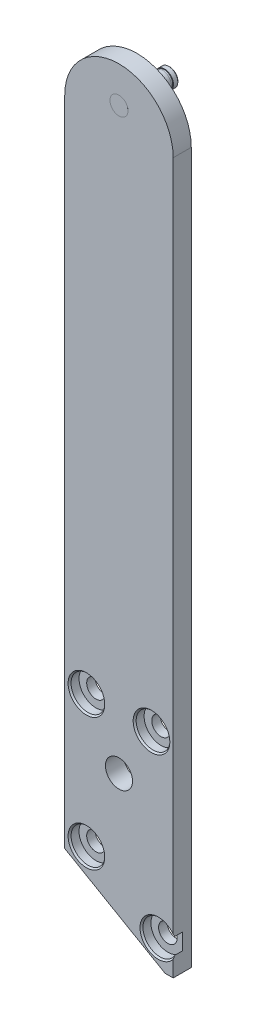
ISO-10303-21;
HEADER;
FILE_DESCRIPTION(('STEP AP214'),'2;1');
FILE_NAME('part.step','',(''),(''),'','','');
FILE_SCHEMA(('AUTOMOTIVE_DESIGN { 1 0 10303 214 1 1 1 1 }'));
ENDSEC;
DATA;
#1=APPLICATION_CONTEXT('core data for automotive mechanical design processes');
#2=APPLICATION_PROTOCOL_DEFINITION('international standard','automotive_design',2000,#1);
#3=PRODUCT_CONTEXT('',#1,'mechanical');
#4=PRODUCT('Part','Part','',(#3));
#5=PRODUCT_RELATED_PRODUCT_CATEGORY('part','',(#4));
#6=PRODUCT_DEFINITION_FORMATION('','',#4);
#7=PRODUCT_DEFINITION_CONTEXT('part definition',#1,'design');
#8=PRODUCT_DEFINITION('design','',#6,#7);
#9=PRODUCT_DEFINITION_SHAPE('','',#8);
#10=(LENGTH_UNIT() NAMED_UNIT(*) SI_UNIT(.MILLI.,.METRE.));
#11=(NAMED_UNIT(*) PLANE_ANGLE_UNIT() SI_UNIT($,.RADIAN.));
#12=(NAMED_UNIT(*) SI_UNIT($,.STERADIAN.) SOLID_ANGLE_UNIT());
#13=UNCERTAINTY_MEASURE_WITH_UNIT(LENGTH_MEASURE(1.E-05),#10,'distance_accuracy_value','');
#14=(GEOMETRIC_REPRESENTATION_CONTEXT(3) GLOBAL_UNCERTAINTY_ASSIGNED_CONTEXT((#13)) GLOBAL_UNIT_ASSIGNED_CONTEXT((#10,
#11,#12)) REPRESENTATION_CONTEXT('',''));
#15=CARTESIAN_POINT('',(0.,0.,0.));
#16=DIRECTION('',(0.,0.,1.));
#17=DIRECTION('',(1.,0.,0.));
#18=AXIS2_PLACEMENT_3D('',#15,#16,#17);
#19=CARTESIAN_POINT('',(0.,0.,6.35));
#20=DIRECTION('',(0.,0.,1.));
#21=DIRECTION('',(1.,0.,0.));
#22=AXIS2_PLACEMENT_3D('',#19,#20,#21);
#23=PLANE('',#22);
#24=CARTESIAN_POINT('',(0.,0.,6.35));
#25=DIRECTION('',(0.,0.,-1.));
#26=DIRECTION('',(-1.,0.,0.));
#27=AXIS2_PLACEMENT_3D('',#24,#25,#26);
#28=CIRCLE('',#27,3.175);
#29=CARTESIAN_POINT('',(-3.175,0.,6.35));
#30=VERTEX_POINT('',#29);
#31=EDGE_CURVE('E54',#30,#30,#28,.T.);
#32=ORIENTED_EDGE('',*,*,#31,.F.);
#33=EDGE_LOOP('',(#32));
#34=FACE_BOUND('',#33,.T.);
#35=ADVANCED_FACE('F43',(#34),#23,.T.);
#36=CARTESIAN_POINT('',(0.,0.,6.35));
#37=DIRECTION('',(0.,0.,-1.));
#38=DIRECTION('',(-1.,0.,0.));
#39=AXIS2_PLACEMENT_3D('',#36,#37,#38);
#40=CYLINDRICAL_SURFACE('',#39,3.175);
#41=ORIENTED_EDGE('',*,*,#31,.T.);
#42=EDGE_LOOP('',(#41));
#43=FACE_BOUND('',#42,.T.);
#44=CARTESIAN_POINT('',(0.,0.,-8.89));
#45=DIRECTION('',(0.,0.,-1.));
#46=DIRECTION('',(-1.,0.,0.));
#47=AXIS2_PLACEMENT_3D('',#44,#45,#46);
#48=CIRCLE('',#47,3.175);
#49=CARTESIAN_POINT('',(-3.175,0.,-8.89));
#50=VERTEX_POINT('',#49);
#51=EDGE_CURVE('E58',#50,#50,#48,.T.);
#52=ORIENTED_EDGE('',*,*,#51,.F.);
#53=EDGE_LOOP('',(#52));
#54=FACE_BOUND('',#53,.T.);
#55=ADVANCED_FACE('F90',(#43,#54),#40,.T.);
#56=CARTESIAN_POINT('',(0.,3.175,-8.89));
#57=DIRECTION('',(0.,0.,-1.));
#58=DIRECTION('',(-1.,0.,0.));
#59=AXIS2_PLACEMENT_3D('',#56,#57,#58);
#60=PLANE('',#59);
#61=ORIENTED_EDGE('',*,*,#51,.T.);
#62=EDGE_LOOP('',(#61));
#63=FACE_BOUND('',#62,.T.);
#64=CARTESIAN_POINT('',(0.,0.,-8.89));
#65=DIRECTION('',(0.,0.,-1.));
#66=DIRECTION('',(-1.,0.,0.));
#67=AXIS2_PLACEMENT_3D('',#64,#65,#66);
#68=CIRCLE('',#67,2.921);
#69=CARTESIAN_POINT('',(-2.921,0.,-8.89));
#70=VERTEX_POINT('',#69);
#71=EDGE_CURVE('E63',#70,#70,#68,.T.);
#72=ORIENTED_EDGE('',*,*,#71,.F.);
#73=EDGE_LOOP('',(#72));
#74=FACE_BOUND('',#73,.T.);
#75=ADVANCED_FACE('F86',(#63,#74),#60,.T.);
#76=CARTESIAN_POINT('',(0.,0.,6.35));
#77=DIRECTION('',(0.,0.,-1.));
#78=DIRECTION('',(-1.,0.,0.));
#79=AXIS2_PLACEMENT_3D('',#76,#77,#78);
#80=CYLINDRICAL_SURFACE('',#79,2.921);
#81=ORIENTED_EDGE('',*,*,#71,.T.);
#82=EDGE_LOOP('',(#81));
#83=FACE_BOUND('',#82,.T.);
#84=CARTESIAN_POINT('',(0.,0.,-9.6266));
#85=DIRECTION('',(0.,0.,-1.));
#86=DIRECTION('',(-1.,0.,0.));
#87=AXIS2_PLACEMENT_3D('',#84,#85,#86);
#88=CIRCLE('',#87,2.921);
#89=CARTESIAN_POINT('',(-2.921,0.,-9.6266));
#90=VERTEX_POINT('',#89);
#91=EDGE_CURVE('E66',#90,#90,#88,.T.);
#92=ORIENTED_EDGE('',*,*,#91,.F.);
#93=EDGE_LOOP('',(#92));
#94=FACE_BOUND('',#93,.T.);
#95=ADVANCED_FACE('F77',(#83,#94),#80,.T.);
#96=CARTESIAN_POINT('',(0.,3.175,-9.6266));
#97=DIRECTION('',(0.,0.,1.));
#98=DIRECTION('',(1.,0.,0.));
#99=AXIS2_PLACEMENT_3D('',#96,#97,#98);
#100=PLANE('',#99);
#101=ORIENTED_EDGE('',*,*,#91,.T.);
#102=EDGE_LOOP('',(#101));
#103=FACE_BOUND('',#102,.T.);
#104=CARTESIAN_POINT('',(0.,0.,-9.6266));
#105=DIRECTION('',(0.,0.,-1.));
#106=DIRECTION('',(-1.,0.,0.));
#107=AXIS2_PLACEMENT_3D('',#104,#105,#106);
#108=CIRCLE('',#107,3.175);
#109=CARTESIAN_POINT('',(-3.175,0.,-9.6266));
#110=VERTEX_POINT('',#109);
#111=EDGE_CURVE('E69',#110,#110,#108,.T.);
#112=ORIENTED_EDGE('',*,*,#111,.F.);
#113=EDGE_LOOP('',(#112));
#114=FACE_BOUND('',#113,.T.);
#115=ADVANCED_FACE('F75',(#103,#114),#100,.T.);
#116=CARTESIAN_POINT('',(0.,0.,6.35));
#117=DIRECTION('',(0.,0.,-1.));
#118=DIRECTION('',(-1.,0.,0.));
#119=AXIS2_PLACEMENT_3D('',#116,#117,#118);
#120=CYLINDRICAL_SURFACE('',#119,3.175);
#121=CARTESIAN_POINT('',(0.,0.,-11.1506));
#122=DIRECTION('',(0.,0.,-1.));
#123=DIRECTION('',(-1.,0.,0.));
#124=AXIS2_PLACEMENT_3D('',#121,#122,#123);
#125=CIRCLE('',#124,3.175);
#126=CARTESIAN_POINT('',(-3.175,0.,-11.1506));
#127=VERTEX_POINT('',#126);
#128=EDGE_CURVE('E11',#127,#127,#125,.F.);
#129=ORIENTED_EDGE('',*,*,#128,.T.);
#130=EDGE_LOOP('',(#129));
#131=FACE_BOUND('',#130,.T.);
#132=ORIENTED_EDGE('',*,*,#111,.T.);
#133=EDGE_LOOP('',(#132));
#134=FACE_BOUND('',#133,.T.);
#135=ADVANCED_FACE('F73',(#131,#134),#120,.T.);
#136=CARTESIAN_POINT('',(0.,0.,-11.5316));
#137=DIRECTION('',(0.,0.,-1.));
#138=DIRECTION('',(-1.,0.,0.));
#139=AXIS2_PLACEMENT_3D('',#136,#137,#138);
#140=PLANE('',#139);
#141=CARTESIAN_POINT('',(0.,0.,-11.5316));
#142=DIRECTION('',(0.,0.,-1.));
#143=DIRECTION('',(-1.,0.,0.));
#144=AXIS2_PLACEMENT_3D('',#141,#142,#143);
#145=CIRCLE('',#144,2.79400000000001);
#146=CARTESIAN_POINT('',(-2.79400000000001,0.,-11.5316));
#147=VERTEX_POINT('',#146);
#148=EDGE_CURVE('E50',#147,#147,#145,.T.);
#149=ORIENTED_EDGE('',*,*,#148,.T.);
#150=EDGE_LOOP('',(#149));
#151=FACE_BOUND('',#150,.T.);
#152=ADVANCED_FACE('F84',(#151),#140,.T.);
#153=CARTESIAN_POINT('',(0.,0.,-11.5316));
#154=DIRECTION('',(0.,0.,1.));
#155=DIRECTION('',(1.,0.,0.));
#156=AXIS2_PLACEMENT_3D('',#153,#154,#155);
#157=CONICAL_SURFACE('',#156,2.79400000000001,0.785398163397442);
#158=ORIENTED_EDGE('',*,*,#128,.F.);
#159=EDGE_LOOP('',(#158));
#160=FACE_BOUND('',#159,.T.);
#161=ORIENTED_EDGE('',*,*,#148,.F.);
#162=EDGE_LOOP('',(#161));
#163=FACE_BOUND('',#162,.T.);
#164=ADVANCED_FACE('F45',(#160,#163),#157,.T.);
#165=CLOSED_SHELL('',(#35,#55,#75,#95,#115,#135,#152,#164));
#166=MANIFOLD_SOLID_BREP('B2',#165);
#167=CARTESIAN_POINT('',(0.,-6.35,6.35));
#168=DIRECTION('',(0.,0.,-1.));
#169=DIRECTION('',(-1.,0.,0.));
#170=AXIS2_PLACEMENT_3D('',#167,#168,#169);
#171=CYLINDRICAL_SURFACE('',#170,19.05);
#172=DIRECTION('',(0.,0.,-1.));
#173=VECTOR('',#172,1.);
#174=CARTESIAN_POINT('',(-19.05,-6.35,6.35));
#175=LINE('',#174,#173);
#176=CARTESIAN_POINT('',(-19.05,-6.35,6.35));
#177=VERTEX_POINT('',#176);
#178=CARTESIAN_POINT('',(-19.05,-6.35,0.));
#179=VERTEX_POINT('',#178);
#180=EDGE_CURVE('E272',#177,#179,#175,.T.);
#181=ORIENTED_EDGE('',*,*,#180,.F.);
#182=CARTESIAN_POINT('',(0.,-6.35,6.35));
#183=DIRECTION('',(0.,0.,1.));
#184=DIRECTION('',(1.,0.,0.));
#185=AXIS2_PLACEMENT_3D('',#182,#183,#184);
#186=CIRCLE('',#185,19.05);
#187=CARTESIAN_POINT('',(19.05,-6.35000000000004,6.35));
#188=VERTEX_POINT('',#187);
#189=EDGE_CURVE('E276',#188,#177,#186,.T.);
#190=ORIENTED_EDGE('',*,*,#189,.F.);
#191=DIRECTION('',(0.,0.,-1.));
#192=VECTOR('',#191,1.);
#193=CARTESIAN_POINT('',(19.05,-6.35,6.35));
#194=LINE('',#193,#192);
#195=CARTESIAN_POINT('',(19.05,-6.35000000000004,0.));
#196=VERTEX_POINT('',#195);
#197=EDGE_CURVE('E244',#196,#188,#194,.F.);
#198=ORIENTED_EDGE('',*,*,#197,.F.);
#199=CARTESIAN_POINT('',(0.,-6.35,0.));
#200=DIRECTION('',(0.,0.,1.));
#201=DIRECTION('',(1.,0.,0.));
#202=AXIS2_PLACEMENT_3D('',#199,#200,#201);
#203=CIRCLE('',#202,19.05);
#204=EDGE_CURVE('E278',#179,#196,#203,.F.);
#205=ORIENTED_EDGE('',*,*,#204,.F.);
#206=EDGE_LOOP('',(#181,#190,#198,#205));
#207=FACE_BOUND('',#206,.T.);
#208=ADVANCED_FACE('F159',(#207),#171,.T.);
#209=CARTESIAN_POINT('',(0.,0.,6.35));
#210=DIRECTION('',(0.,0.,1.));
#211=DIRECTION('',(1.,0.,0.));
#212=AXIS2_PLACEMENT_3D('',#209,#210,#211);
#213=PLANE('',#212);
#214=CARTESIAN_POINT('',(-11.43,-184.7,6.35));
#215=DIRECTION('',(0.,0.,1.));
#216=DIRECTION('',(1.,0.,0.));
#217=AXIS2_PLACEMENT_3D('',#214,#215,#216);
#218=CIRCLE('',#217,6.4389);
#219=CARTESIAN_POINT('',(-4.99110000000003,-184.7,6.35));
#220=VERTEX_POINT('',#219);
#221=EDGE_CURVE('E410',#220,#220,#218,.T.);
#222=ORIENTED_EDGE('',*,*,#221,.F.);
#223=EDGE_LOOP('',(#222));
#224=FACE_BOUND('',#223,.T.);
#225=CARTESIAN_POINT('',(11.43,-184.7,6.35));
#226=DIRECTION('',(0.,0.,1.));
#227=DIRECTION('',(1.,0.,0.));
#228=AXIS2_PLACEMENT_3D('',#225,#226,#227);
#229=CIRCLE('',#228,6.4389);
#230=CARTESIAN_POINT('',(17.8689,-184.7,6.35));
#231=VERTEX_POINT('',#230);
#232=EDGE_CURVE('E398',#231,#231,#229,.T.);
#233=ORIENTED_EDGE('',*,*,#232,.F.);
#234=EDGE_LOOP('',(#233));
#235=FACE_BOUND('',#234,.T.);
#236=CARTESIAN_POINT('',(13.834070214,-246.4,6.35));
#237=DIRECTION('',(0.,0.,1.));
#238=DIRECTION('',(1.,0.,0.));
#239=AXIS2_PLACEMENT_3D('',#236,#237,#238);
#240=CIRCLE('',#239,6.4389);
#241=CARTESIAN_POINT('',(19.05,-242.624617942841,6.35));
#242=VERTEX_POINT('',#241);
#243=CARTESIAN_POINT('',(19.05,-250.175382057159,6.35));
#244=VERTEX_POINT('',#243);
#245=EDGE_CURVE('E177',#242,#244,#240,.T.);
#246=ORIENTED_EDGE('',*,*,#245,.F.);
#247=DIRECTION('',(0.,1.,0.));
#248=VECTOR('',#247,1.);
#249=CARTESIAN_POINT('',(19.05,12.7,6.35));
#250=LINE('',#249,#248);
#251=EDGE_CURVE('E184',#242,#188,#250,.T.);
#252=ORIENTED_EDGE('',*,*,#251,.T.);
#253=ORIENTED_EDGE('',*,*,#189,.T.);
#254=DIRECTION('',(0.,-1.,0.));
#255=VECTOR('',#254,1.);
#256=CARTESIAN_POINT('',(-19.05,12.7,6.35));
#257=LINE('',#256,#255);
#258=CARTESIAN_POINT('',(-19.05,-235.560177465372,6.35));
#259=VERTEX_POINT('',#258);
#260=EDGE_CURVE('E263',#177,#259,#257,.T.);
#261=ORIENTED_EDGE('',*,*,#260,.T.);
#262=DIRECTION('',(0.866025403784439,-0.5,0.));
#263=VECTOR('',#262,1.);
#264=CARTESIAN_POINT('',(16.1840702139999,-255.902577388071,6.35));
#265=LINE('',#264,#263);
#266=CARTESIAN_POINT('',(16.1840702139999,-255.902577388071,6.35));
#267=VERTEX_POINT('',#266);
#268=EDGE_CURVE('E250',#259,#267,#265,.T.);
#269=ORIENTED_EDGE('',*,*,#268,.T.);
#270=DIRECTION('',(1.,0.,0.));
#271=VECTOR('',#270,1.);
#272=CARTESIAN_POINT('',(16.1840702139999,-255.902577388071,6.35));
#273=LINE('',#272,#271);
#274=CARTESIAN_POINT('',(19.05,-255.902577388071,6.35));
#275=VERTEX_POINT('',#274);
#276=EDGE_CURVE('E246',#267,#275,#273,.T.);
#277=ORIENTED_EDGE('',*,*,#276,.T.);
#278=EDGE_CURVE('E245',#275,#244,#250,.T.);
#279=ORIENTED_EDGE('',*,*,#278,.T.);
#280=EDGE_LOOP('',(#246,#252,#253,#261,#269,#277,#279));
#281=FACE_BOUND('',#280,.T.);
#282=CARTESIAN_POINT('',(-11.43,-231.16,6.35));
#283=DIRECTION('',(0.,0.,1.));
#284=DIRECTION('',(1.,0.,0.));
#285=AXIS2_PLACEMENT_3D('',#282,#283,#284);
#286=CIRCLE('',#285,6.4389);
#287=CARTESIAN_POINT('',(-4.99110000000003,-231.16,6.35));
#288=VERTEX_POINT('',#287);
#289=EDGE_CURVE('E379',#288,#288,#286,.T.);
#290=ORIENTED_EDGE('',*,*,#289,.F.);
#291=EDGE_LOOP('',(#290));
#292=FACE_BOUND('',#291,.T.);
#293=CARTESIAN_POINT('',(0.,0.,6.35));
#294=DIRECTION('',(0.,0.,1.));
#295=DIRECTION('',(1.,0.,0.));
#296=AXIS2_PLACEMENT_3D('',#293,#294,#295);
#297=CIRCLE('',#296,3.175);
#298=CARTESIAN_POINT('',(3.175,0.,6.35));
#299=VERTEX_POINT('',#298);
#300=EDGE_CURVE('E257',#299,#299,#297,.T.);
#301=ORIENTED_EDGE('',*,*,#300,.F.);
#302=EDGE_LOOP('',(#301));
#303=FACE_BOUND('',#302,.T.);
#304=CARTESIAN_POINT('',(0.,-203.2,6.35));
#305=DIRECTION('',(0.,0.,1.));
#306=DIRECTION('',(1.,0.,0.));
#307=AXIS2_PLACEMENT_3D('',#304,#305,#306);
#308=CIRCLE('',#307,4.7625);
#309=CARTESIAN_POINT('',(4.76249999999991,-203.2,6.35));
#310=VERTEX_POINT('',#309);
#311=EDGE_CURVE('E364',#310,#310,#308,.T.);
#312=ORIENTED_EDGE('',*,*,#311,.F.);
#313=EDGE_LOOP('',(#312));
#314=FACE_BOUND('',#313,.T.);
#315=ADVANCED_FACE('F336',(#224,#235,#281,#292,#303,#314),#213,.T.);
#316=CARTESIAN_POINT('',(0.,0.,0.));
#317=DIRECTION('',(0.,0.,1.));
#318=DIRECTION('',(1.,0.,0.));
#319=AXIS2_PLACEMENT_3D('',#316,#317,#318);
#320=PLANE('',#319);
#321=CARTESIAN_POINT('',(-11.43,-184.7,0.));
#322=DIRECTION('',(0.,0.,1.));
#323=DIRECTION('',(1.,0.,0.));
#324=AXIS2_PLACEMENT_3D('',#321,#322,#323);
#325=CIRCLE('',#324,3.2639);
#326=CARTESIAN_POINT('',(-8.16610000000003,-184.7,0.));
#327=VERTEX_POINT('',#326);
#328=EDGE_CURVE('E163',#327,#327,#325,.T.);
#329=ORIENTED_EDGE('',*,*,#328,.T.);
#330=EDGE_LOOP('',(#329));
#331=FACE_BOUND('',#330,.T.);
#332=CARTESIAN_POINT('',(11.43,-184.7,0.));
#333=DIRECTION('',(0.,0.,1.));
#334=DIRECTION('',(1.,0.,0.));
#335=AXIS2_PLACEMENT_3D('',#332,#333,#334);
#336=CIRCLE('',#335,3.2639);
#337=CARTESIAN_POINT('',(14.6939,-184.7,0.));
#338=VERTEX_POINT('',#337);
#339=EDGE_CURVE('E388',#338,#338,#336,.T.);
#340=ORIENTED_EDGE('',*,*,#339,.T.);
#341=EDGE_LOOP('',(#340));
#342=FACE_BOUND('',#341,.T.);
#343=CARTESIAN_POINT('',(13.834070214,-246.4,0.));
#344=DIRECTION('',(0.,0.,1.));
#345=DIRECTION('',(1.,0.,0.));
#346=AXIS2_PLACEMENT_3D('',#343,#344,#345);
#347=CIRCLE('',#346,3.2639);
#348=CARTESIAN_POINT('',(17.097970214,-246.4,0.));
#349=VERTEX_POINT('',#348);
#350=EDGE_CURVE('E382',#349,#349,#347,.T.);
#351=ORIENTED_EDGE('',*,*,#350,.T.);
#352=EDGE_LOOP('',(#351));
#353=FACE_BOUND('',#352,.T.);
#354=CARTESIAN_POINT('',(-11.43,-231.16,0.));
#355=DIRECTION('',(0.,0.,1.));
#356=DIRECTION('',(1.,0.,0.));
#357=AXIS2_PLACEMENT_3D('',#354,#355,#356);
#358=CIRCLE('',#357,3.2639);
#359=CARTESIAN_POINT('',(-8.16610000000003,-231.16,0.));
#360=VERTEX_POINT('',#359);
#361=EDGE_CURVE('E280',#360,#360,#358,.T.);
#362=ORIENTED_EDGE('',*,*,#361,.T.);
#363=EDGE_LOOP('',(#362));
#364=FACE_BOUND('',#363,.T.);
#365=DIRECTION('',(0.,-1.,0.));
#366=VECTOR('',#365,1.);
#367=CARTESIAN_POINT('',(-19.05,12.7,0.));
#368=LINE('',#367,#366);
#369=CARTESIAN_POINT('',(-19.05,-235.560177465372,0.));
#370=VERTEX_POINT('',#369);
#371=EDGE_CURVE('E254',#179,#370,#368,.T.);
#372=ORIENTED_EDGE('',*,*,#371,.F.);
#373=ORIENTED_EDGE('',*,*,#204,.T.);
#374=DIRECTION('',(0.,1.,0.));
#375=VECTOR('',#374,1.);
#376=CARTESIAN_POINT('',(19.05,12.7,0.));
#377=LINE('',#376,#375);
#378=CARTESIAN_POINT('',(19.05,-255.902577388071,0.));
#379=VERTEX_POINT('',#378);
#380=EDGE_CURVE('E261',#379,#196,#377,.T.);
#381=ORIENTED_EDGE('',*,*,#380,.F.);
#382=DIRECTION('',(1.,0.,0.));
#383=VECTOR('',#382,1.);
#384=CARTESIAN_POINT('',(16.1840702139999,-255.902577388071,0.));
#385=LINE('',#384,#383);
#386=CARTESIAN_POINT('',(16.1840702139999,-255.902577388071,0.));
#387=VERTEX_POINT('',#386);
#388=EDGE_CURVE('E259',#387,#379,#385,.T.);
#389=ORIENTED_EDGE('',*,*,#388,.F.);
#390=DIRECTION('',(0.866025403784439,-0.5,0.));
#391=VECTOR('',#390,1.);
#392=CARTESIAN_POINT('',(16.1840702139999,-255.902577388071,0.));
#393=LINE('',#392,#391);
#394=EDGE_CURVE('E256',#370,#387,#393,.T.);
#395=ORIENTED_EDGE('',*,*,#394,.F.);
#396=EDGE_LOOP('',(#372,#373,#381,#389,#395));
#397=FACE_BOUND('',#396,.T.);
#398=CARTESIAN_POINT('',(0.,0.,0.));
#399=DIRECTION('',(0.,0.,1.));
#400=DIRECTION('',(1.,0.,0.));
#401=AXIS2_PLACEMENT_3D('',#398,#399,#400);
#402=CIRCLE('',#401,3.175);
#403=CARTESIAN_POINT('',(3.175,0.,0.));
#404=VERTEX_POINT('',#403);
#405=EDGE_CURVE('E361',#404,#404,#402,.T.);
#406=ORIENTED_EDGE('',*,*,#405,.T.);
#407=EDGE_LOOP('',(#406));
#408=FACE_BOUND('',#407,.T.);
#409=CARTESIAN_POINT('',(0.,-203.2,0.));
#410=DIRECTION('',(0.,0.,1.));
#411=DIRECTION('',(1.,0.,0.));
#412=AXIS2_PLACEMENT_3D('',#409,#410,#411);
#413=CIRCLE('',#412,4.7625);
#414=CARTESIAN_POINT('',(4.76249999999991,-203.2,0.));
#415=VERTEX_POINT('',#414);
#416=EDGE_CURVE('E282',#415,#415,#413,.T.);
#417=ORIENTED_EDGE('',*,*,#416,.T.);
#418=EDGE_LOOP('',(#417));
#419=FACE_BOUND('',#418,.T.);
#420=ADVANCED_FACE('F338',(#331,#342,#353,#364,#397,#408,#419),#320,.F.);
#421=CARTESIAN_POINT('',(-19.05,12.7,6.35));
#422=DIRECTION('',(1.,0.,0.));
#423=DIRECTION('',(0.,1.,0.));
#424=AXIS2_PLACEMENT_3D('',#421,#422,#423);
#425=PLANE('',#424);
#426=ORIENTED_EDGE('',*,*,#260,.F.);
#427=ORIENTED_EDGE('',*,*,#180,.T.);
#428=ORIENTED_EDGE('',*,*,#371,.T.);
#429=DIRECTION('',(0.,0.,-1.));
#430=VECTOR('',#429,1.);
#431=CARTESIAN_POINT('',(-19.05,-235.560177465372,6.35));
#432=LINE('',#431,#430);
#433=EDGE_CURVE('E269',#259,#370,#432,.T.);
#434=ORIENTED_EDGE('',*,*,#433,.F.);
#435=EDGE_LOOP('',(#426,#427,#428,#434));
#436=FACE_BOUND('',#435,.T.);
#437=ADVANCED_FACE('F341',(#436),#425,.F.);
#438=CARTESIAN_POINT('',(16.1840702139999,-255.902577388071,6.35));
#439=DIRECTION('',(0.5,0.866025403784439,0.));
#440=DIRECTION('',(-0.866025403784439,0.5,0.));
#441=AXIS2_PLACEMENT_3D('',#438,#439,#440);
#442=PLANE('',#441);
#443=ORIENTED_EDGE('',*,*,#394,.T.);
#444=DIRECTION('',(0.,0.,-1.));
#445=VECTOR('',#444,1.);
#446=CARTESIAN_POINT('',(16.1840702139999,-255.902577388071,6.35));
#447=LINE('',#446,#445);
#448=EDGE_CURVE('E266',#267,#387,#447,.T.);
#449=ORIENTED_EDGE('',*,*,#448,.F.);
#450=ORIENTED_EDGE('',*,*,#268,.F.);
#451=ORIENTED_EDGE('',*,*,#433,.T.);
#452=EDGE_LOOP('',(#443,#449,#450,#451));
#453=FACE_BOUND('',#452,.T.);
#454=ADVANCED_FACE('F346',(#453),#442,.F.);
#455=CARTESIAN_POINT('',(16.1840702139999,-255.902577388071,6.35));
#456=DIRECTION('',(0.,1.,0.));
#457=DIRECTION('',(-1.,0.,0.));
#458=AXIS2_PLACEMENT_3D('',#455,#456,#457);
#459=PLANE('',#458);
#460=ORIENTED_EDGE('',*,*,#388,.T.);
#461=DIRECTION('',(0.,0.,-1.));
#462=VECTOR('',#461,1.);
#463=CARTESIAN_POINT('',(19.05,-255.902577388071,6.35));
#464=LINE('',#463,#462);
#465=EDGE_CURVE('E249',#275,#379,#464,.T.);
#466=ORIENTED_EDGE('',*,*,#465,.F.);
#467=ORIENTED_EDGE('',*,*,#276,.F.);
#468=ORIENTED_EDGE('',*,*,#448,.T.);
#469=EDGE_LOOP('',(#460,#466,#467,#468));
#470=FACE_BOUND('',#469,.T.);
#471=ADVANCED_FACE('F571',(#470),#459,.F.);
#472=CARTESIAN_POINT('',(19.05,12.7,6.35));
#473=DIRECTION('',(-1.,0.,0.));
#474=DIRECTION('',(0.,-1.,0.));
#475=AXIS2_PLACEMENT_3D('',#472,#473,#474);
#476=PLANE('',#475);
#477=ORIENTED_EDGE('',*,*,#251,.F.);
#478=CARTESIAN_POINT('',(19.05,-234.315530892534,14.0841324353691));
#479=CARTESIAN_POINT('',(19.05,-234.480429542362,13.9099714759903));
#480=CARTESIAN_POINT('',(19.05,-234.645604818501,13.7360725455168));
#481=CARTESIAN_POINT('',(19.05,-234.976582680946,13.3888713302993));
#482=CARTESIAN_POINT('',(19.05,-235.142385269972,13.2155690481495));
#483=CARTESIAN_POINT('',(19.05,-235.640888033083,12.6966213828978));
#484=CARTESIAN_POINT('',(19.05,-235.974638492412,12.3519824850765));
#485=CARTESIAN_POINT('',(19.05,-236.64452774329,11.6674225829043));
#486=CARTESIAN_POINT('',(19.05,-236.980653835095,11.3274891661536));
#487=CARTESIAN_POINT('',(19.05,-237.657526963078,10.6522780306148));
#488=CARTESIAN_POINT('',(19.05,-237.998273718147,10.3170000310937));
#489=CARTESIAN_POINT('',(19.05,-238.568942402195,9.76591376113658));
#490=CARTESIAN_POINT('',(19.05,-238.797106436562,9.54828702435431));
#491=CARTESIAN_POINT('',(19.05,-239.256774824871,9.11659505643807));
#492=CARTESIAN_POINT('',(19.05,-239.488279083486,8.90252972403778));
#493=CARTESIAN_POINT('',(19.05,-239.956318704591,8.47819821387494));
#494=CARTESIAN_POINT('',(19.05,-240.192869485597,8.26794897932855));
#495=CARTESIAN_POINT('',(19.05,-240.671249683664,7.85358709082494));
#496=CARTESIAN_POINT('',(19.05,-240.91307842105,7.6494736546769));
#497=CARTESIAN_POINT('',(19.05,-241.405595592251,7.24784108183705));
#498=CARTESIAN_POINT('',(19.05,-241.656341146937,7.05039124571206));
#499=CARTESIAN_POINT('',(19.05,-242.039270573747,6.76307879119391));
#500=CARTESIAN_POINT('',(19.05,-242.16810273139,6.66874843019873));
#501=CARTESIAN_POINT('',(19.05,-242.428328273828,6.48369766971674));
#502=CARTESIAN_POINT('',(19.05,-242.559721447409,6.39297697439286));
#503=CARTESIAN_POINT('',(19.05,-242.824979388675,6.21619219781606));
#504=CARTESIAN_POINT('',(19.05,-242.958834393977,6.13011352537645));
#505=CARTESIAN_POINT('',(19.05,-243.229830214633,5.96323199130039));
#506=CARTESIAN_POINT('',(19.05,-243.366971376837,5.8824296899616));
#507=CARTESIAN_POINT('',(19.05,-243.644715128951,5.72741347694497));
#508=CARTESIAN_POINT('',(19.05,-243.785312935497,5.65319105053984));
#509=CARTESIAN_POINT('',(19.05,-244.070412916397,5.51272683507873));
#510=CARTESIAN_POINT('',(19.05,-244.214913733316,5.44648231403851));
#511=CARTESIAN_POINT('',(19.05,-244.506850255547,5.32423592034426));
#512=CARTESIAN_POINT('',(19.05,-244.654252679588,5.26815537992671));
#513=CARTESIAN_POINT('',(19.05,-244.952998051355,5.1675824859678));
#514=CARTESIAN_POINT('',(19.05,-245.10434071385,5.12308929617458));
#515=CARTESIAN_POINT('',(19.05,-245.409624165665,5.04794432330524));
#516=CARTESIAN_POINT('',(19.05,-245.563546920879,5.0172203898057));
#517=CARTESIAN_POINT('',(19.05,-245.873682279639,4.97101168751411));
#518=CARTESIAN_POINT('',(19.05,-246.029894576147,4.95552489398512));
#519=CARTESIAN_POINT('',(19.05,-246.34447587487,4.94072696059279));
#520=CARTESIAN_POINT('',(19.05,-246.502851768109,4.94155911235564));
#521=CARTESIAN_POINT('',(19.05,-246.818646071966,4.9596940667591));
#522=CARTESIAN_POINT('',(19.05,-246.976064432923,4.97699771643593));
#523=CARTESIAN_POINT('',(19.05,-247.289066481506,5.02704979850625));
#524=CARTESIAN_POINT('',(19.05,-247.444639614354,5.05986314367539));
#525=CARTESIAN_POINT('',(19.05,-247.752255478389,5.13909975725434));
#526=CARTESIAN_POINT('',(19.05,-247.904297356728,5.18552627730395));
#527=CARTESIAN_POINT('',(19.05,-248.270948023467,5.31303666299252));
#528=CARTESIAN_POINT('',(19.05,-248.483377665538,5.40035732654883));
#529=CARTESIAN_POINT('',(19.05,-248.899838817505,5.5930456423848));
#530=CARTESIAN_POINT('',(19.05,-249.103864645328,5.69842526426406));
#531=CARTESIAN_POINT('',(19.05,-249.506249553967,5.92360313298937));
#532=CARTESIAN_POINT('',(19.05,-249.704537114691,6.04352789778617));
#533=CARTESIAN_POINT('',(19.05,-249.996993139486,6.23097971982261));
#534=CARTESIAN_POINT('',(19.05,-250.093634338365,6.29471373885667));
#535=CARTESIAN_POINT('',(19.05,-250.28542046825,6.42439194624005));
#536=CARTESIAN_POINT('',(19.05,-250.380565441714,6.49033607170748));
#537=CARTESIAN_POINT('',(19.05,-250.67079950478,6.69588106768704));
#538=CARTESIAN_POINT('',(19.05,-250.863655222238,6.83863765323076));
#539=CARTESIAN_POINT('',(19.05,-251.244595613851,7.13040215160716));
#540=CARTESIAN_POINT('',(19.05,-251.43267940005,7.27941121440178));
#541=CARTESIAN_POINT('',(19.05,-251.805009601154,7.58236097239818));
#542=CARTESIAN_POINT('',(19.05,-251.989253625565,7.73630459674427));
#543=CARTESIAN_POINT('',(19.05,-252.354477972065,8.04802444633922));
#544=CARTESIAN_POINT('',(19.05,-252.535458105389,8.20580089202764));
#545=CARTESIAN_POINT('',(19.05,-252.895259703224,8.52492691891395));
#546=CARTESIAN_POINT('',(19.05,-253.074072518038,8.68628623218031));
#547=CARTESIAN_POINT('',(19.05,-253.429394003792,9.01152510039256));
#548=CARTESIAN_POINT('',(19.05,-253.6059026209,9.17540471402567));
#549=CARTESIAN_POINT('',(19.05,-254.132387539362,9.67001011443059));
#550=CARTESIAN_POINT('',(19.05,-254.479460697393,10.0038259449066));
#551=CARTESIAN_POINT('',(19.05,-255.13671465953,10.6466763898562));
#552=CARTESIAN_POINT('',(19.05,-255.447386176875,10.9552122132226));
#553=CARTESIAN_POINT('',(19.05,-256.06513825436,11.5759183027021));
#554=CARTESIAN_POINT('',(19.05,-256.372218440274,11.8880889409277));
#555=CARTESIAN_POINT('',(19.05,-256.981449360241,12.5130510918881));
#556=CARTESIAN_POINT('',(19.05,-257.28361943987,12.8258237858304));
#557=CARTESIAN_POINT('',(19.05,-257.885639840107,13.4535024956276));
#558=CARTESIAN_POINT('',(19.05,-258.185490511082,13.7684081752425));
#559=CARTESIAN_POINT('',(19.05,-258.484469107466,14.084132435369));
#560=B_SPLINE_CURVE_WITH_KNOTS('',3,(#478,#479,#480,#481,#482,#483,#484,#485,#486,#487,#488,
#489,#490,#491,#492,#493,#494,#495,#496,#497,#498,#499,#500,#501,#502,#503,#504,#505,#506,#507,
#508,#509,#510,#511,#512,#513,#514,#515,#516,#517,#518,#519,#520,#521,#522,#523,#524,#525,#526,
#527,#528,#529,#530,#531,#532,#533,#534,#535,#536,#537,#538,#539,#540,#541,#542,#543,#544,#545,
#546,#547,#548,#549,#550,#551,#552,#553,#554,#555,#556,#557,#558,#559),.UNSPECIFIED.,.F.,.F.,(4,
2,2,2,2,2,2,2,2,2,2,2,2,2,2,2,2,2,2,2,2,2,2,2,2,2,2,2,2,2,2,2,2,2,2,2,2,2,2,2,4),(0.,
0.719521695762641,1.43904651595651,2.87829142199581,4.31242244990232,5.74646661733328,
6.69236685055465,7.63824014156442,8.58760539313097,9.53684910203029,10.4940196475691,
10.9729950371016,11.4519310900883,11.9292615666059,12.4066426486782,12.8833966694183,
13.3599869616484,13.8327143456375,14.3054076037265,14.7755941456884,15.2457182000257,
15.7199721025746,16.1942503946441,16.6705315033897,17.1469264693335,17.8347482184583,
18.5230276363168,19.2177931658074,19.5650658643701,19.9123286907119,20.6319719893288,
21.3517482306528,22.0719599438355,22.7922131775537,23.5147470135209,24.2372976998177,
25.681844155134,26.9953575357769,28.309006590143,29.6136791728393,30.9181506659086),.UNSPECIFIED.);
#561=CARTESIAN_POINT('',(19.05,-243.529227524669,5.7919102709208));
#562=VERTEX_POINT('',#561);
#563=EDGE_CURVE('E41',#242,#562,#560,.T.);
#564=ORIENTED_EDGE('',*,*,#563,.T.);
#565=DIRECTION('',(0.,0.,1.));
#566=VECTOR('',#565,1.);
#567=CARTESIAN_POINT('',(19.05,-243.529227524669,6.35));
#568=LINE('',#567,#566);
#569=CARTESIAN_POINT('',(19.05,-243.529227524669,2.9972));
#570=VERTEX_POINT('',#569);
#571=EDGE_CURVE('E168',#562,#570,#568,.F.);
#572=ORIENTED_EDGE('',*,*,#571,.T.);
#573=DIRECTION('',(0.,-1.,0.));
#574=VECTOR('',#573,1.);
#575=CARTESIAN_POINT('',(19.05,12.7,2.9972));
#576=LINE('',#575,#574);
#577=CARTESIAN_POINT('',(19.05,-249.270772475331,2.9972));
#578=VERTEX_POINT('',#577);
#579=EDGE_CURVE('E236',#570,#578,#576,.T.);
#580=ORIENTED_EDGE('',*,*,#579,.T.);
#581=DIRECTION('',(0.,0.,1.));
#582=VECTOR('',#581,1.);
#583=CARTESIAN_POINT('',(19.05,-249.270772475331,6.35));
#584=LINE('',#583,#582);
#585=CARTESIAN_POINT('',(19.05,-249.270772475331,5.7919102709208));
#586=VERTEX_POINT('',#585);
#587=EDGE_CURVE('E291',#578,#586,#584,.T.);
#588=ORIENTED_EDGE('',*,*,#587,.T.);
#589=EDGE_CURVE('E170',#586,#244,#560,.T.);
#590=ORIENTED_EDGE('',*,*,#589,.T.);
#591=ORIENTED_EDGE('',*,*,#278,.F.);
#592=ORIENTED_EDGE('',*,*,#465,.T.);
#593=ORIENTED_EDGE('',*,*,#380,.T.);
#594=ORIENTED_EDGE('',*,*,#197,.T.);
#595=EDGE_LOOP('',(#477,#564,#572,#580,#588,#590,#591,#592,#593,#594));
#596=FACE_BOUND('',#595,.T.);
#597=ADVANCED_FACE('F240',(#596),#476,.F.);
#598=CARTESIAN_POINT('',(0.,0.,6.35));
#599=DIRECTION('',(0.,0.,-1.));
#600=DIRECTION('',(-1.,0.,0.));
#601=AXIS2_PLACEMENT_3D('',#598,#599,#600);
#602=CYLINDRICAL_SURFACE('',#601,3.175);
#603=ORIENTED_EDGE('',*,*,#300,.T.);
#604=EDGE_LOOP('',(#603));
#605=FACE_BOUND('',#604,.T.);
#606=ORIENTED_EDGE('',*,*,#405,.F.);
#607=EDGE_LOOP('',(#606));
#608=FACE_BOUND('',#607,.T.);
#609=ADVANCED_FACE('F331',(#605,#608),#602,.F.);
#610=CARTESIAN_POINT('',(0.,-203.2,6.35));
#611=DIRECTION('',(0.,0.,-1.));
#612=DIRECTION('',(-1.,0.,0.));
#613=AXIS2_PLACEMENT_3D('',#610,#611,#612);
#614=CYLINDRICAL_SURFACE('',#613,4.7625);
#615=ORIENTED_EDGE('',*,*,#311,.T.);
#616=EDGE_LOOP('',(#615));
#617=FACE_BOUND('',#616,.T.);
#618=ORIENTED_EDGE('',*,*,#416,.F.);
#619=EDGE_LOOP('',(#618));
#620=FACE_BOUND('',#619,.T.);
#621=ADVANCED_FACE('F327',(#617,#620),#614,.F.);
#622=CARTESIAN_POINT('',(-11.43,-231.16,6.35));
#623=DIRECTION('',(0.,0.,1.));
#624=DIRECTION('',(1.,0.,0.));
#625=AXIS2_PLACEMENT_3D('',#622,#623,#624);
#626=CYLINDRICAL_SURFACE('',#625,3.2639);
#627=CARTESIAN_POINT('',(-11.43,-231.16,2.9972));
#628=DIRECTION('',(0.,0.,1.));
#629=DIRECTION('',(1.,0.,0.));
#630=AXIS2_PLACEMENT_3D('',#627,#628,#629);
#631=CIRCLE('',#630,3.2639);
#632=CARTESIAN_POINT('',(-8.16610000000003,-231.16,2.9972));
#633=VERTEX_POINT('',#632);
#634=EDGE_CURVE('E283',#633,#633,#631,.T.);
#635=ORIENTED_EDGE('',*,*,#634,.T.);
#636=EDGE_LOOP('',(#635));
#637=FACE_BOUND('',#636,.T.);
#638=ORIENTED_EDGE('',*,*,#361,.F.);
#639=EDGE_LOOP('',(#638));
#640=FACE_BOUND('',#639,.T.);
#641=ADVANCED_FACE('F323',(#637,#640),#626,.F.);
#642=CARTESIAN_POINT('',(-8.16610000000003,-231.16,2.9972));
#643=DIRECTION('',(0.,0.,-1.));
#644=DIRECTION('',(-1.,0.,0.));
#645=AXIS2_PLACEMENT_3D('',#642,#643,#644);
#646=PLANE('',#645);
#647=ORIENTED_EDGE('',*,*,#634,.F.);
#648=EDGE_LOOP('',(#647));
#649=FACE_BOUND('',#648,.T.);
#650=CARTESIAN_POINT('',(-11.43,-231.16,2.9972));
#651=DIRECTION('',(0.,0.,1.));
#652=DIRECTION('',(1.,0.,0.));
#653=AXIS2_PLACEMENT_3D('',#650,#651,#652);
#654=CIRCLE('',#653,5.95376);
#655=CARTESIAN_POINT('',(-5.47624000000003,-231.16,2.9972));
#656=VERTEX_POINT('',#655);
#657=EDGE_CURVE('E373',#656,#656,#654,.T.);
#658=ORIENTED_EDGE('',*,*,#657,.T.);
#659=EDGE_LOOP('',(#658));
#660=FACE_BOUND('',#659,.T.);
#661=ADVANCED_FACE('F319',(#649,#660),#646,.F.);
#662=CARTESIAN_POINT('',(-11.43,-231.16,6.35));
#663=DIRECTION('',(0.,0.,1.));
#664=DIRECTION('',(1.,0.,0.));
#665=AXIS2_PLACEMENT_3D('',#662,#663,#664);
#666=CYLINDRICAL_SURFACE('',#665,5.95376);
#667=ORIENTED_EDGE('',*,*,#657,.F.);
#668=EDGE_LOOP('',(#667));
#669=FACE_BOUND('',#668,.T.);
#670=CARTESIAN_POINT('',(-11.43,-231.16,5.7919102709208));
#671=DIRECTION('',(0.,0.,1.));
#672=DIRECTION('',(1.,0.,0.));
#673=AXIS2_PLACEMENT_3D('',#670,#671,#672);
#674=CIRCLE('',#673,5.95376);
#675=CARTESIAN_POINT('',(-5.47624000000003,-231.16,5.7919102709208));
#676=VERTEX_POINT('',#675);
#677=EDGE_CURVE('E376',#676,#676,#674,.T.);
#678=ORIENTED_EDGE('',*,*,#677,.T.);
#679=EDGE_LOOP('',(#678));
#680=FACE_BOUND('',#679,.T.);
#681=ADVANCED_FACE('F315',(#669,#680),#666,.F.);
#682=CARTESIAN_POINT('',(-11.43,-231.16,6.35));
#683=DIRECTION('',(0.,0.,1.));
#684=DIRECTION('',(1.,0.,0.));
#685=AXIS2_PLACEMENT_3D('',#682,#683,#684);
#686=CONICAL_SURFACE('',#685,6.4389,0.715584993317675);
#687=ORIENTED_EDGE('',*,*,#677,.F.);
#688=EDGE_LOOP('',(#687));
#689=FACE_BOUND('',#688,.T.);
#690=ORIENTED_EDGE('',*,*,#289,.T.);
#691=EDGE_LOOP('',(#690));
#692=FACE_BOUND('',#691,.T.);
#693=ADVANCED_FACE('F311',(#689,#692),#686,.F.);
#694=CARTESIAN_POINT('',(13.834070214,-246.4,6.35));
#695=DIRECTION('',(0.,0.,1.));
#696=DIRECTION('',(1.,0.,0.));
#697=AXIS2_PLACEMENT_3D('',#694,#695,#696);
#698=CYLINDRICAL_SURFACE('',#697,3.2639);
#699=CARTESIAN_POINT('',(13.834070214,-246.4,2.9972));
#700=DIRECTION('',(0.,0.,1.));
#701=DIRECTION('',(1.,0.,0.));
#702=AXIS2_PLACEMENT_3D('',#699,#700,#701);
#703=CIRCLE('',#702,3.2639);
#704=CARTESIAN_POINT('',(17.097970214,-246.4,2.9972));
#705=VERTEX_POINT('',#704);
#706=EDGE_CURVE('E383',#705,#705,#703,.T.);
#707=ORIENTED_EDGE('',*,*,#706,.T.);
#708=EDGE_LOOP('',(#707));
#709=FACE_BOUND('',#708,.T.);
#710=ORIENTED_EDGE('',*,*,#350,.F.);
#711=EDGE_LOOP('',(#710));
#712=FACE_BOUND('',#711,.T.);
#713=ADVANCED_FACE('F307',(#709,#712),#698,.F.);
#714=CARTESIAN_POINT('',(17.097970214,-246.4,2.9972));
#715=DIRECTION('',(0.,0.,-1.));
#716=DIRECTION('',(-1.,0.,0.));
#717=AXIS2_PLACEMENT_3D('',#714,#715,#716);
#718=PLANE('',#717);
#719=ORIENTED_EDGE('',*,*,#706,.F.);
#720=EDGE_LOOP('',(#719));
#721=FACE_BOUND('',#720,.T.);
#722=CARTESIAN_POINT('',(13.834070214,-246.4,2.9972));
#723=DIRECTION('',(0.,0.,1.));
#724=DIRECTION('',(1.,0.,0.));
#725=AXIS2_PLACEMENT_3D('',#722,#723,#724);
#726=CIRCLE('',#725,5.95376);
#727=EDGE_CURVE('E233',#570,#578,#726,.T.);
#728=ORIENTED_EDGE('',*,*,#727,.T.);
#729=ORIENTED_EDGE('',*,*,#579,.F.);
#730=EDGE_LOOP('',(#728,#729));
#731=FACE_BOUND('',#730,.T.);
#732=ADVANCED_FACE('F304',(#721,#731),#718,.F.);
#733=CARTESIAN_POINT('',(13.834070214,-246.4,6.35));
#734=DIRECTION('',(0.,0.,1.));
#735=DIRECTION('',(1.,0.,0.));
#736=AXIS2_PLACEMENT_3D('',#733,#734,#735);
#737=CYLINDRICAL_SURFACE('',#736,5.95376);
#738=ORIENTED_EDGE('',*,*,#727,.F.);
#739=ORIENTED_EDGE('',*,*,#571,.F.);
#740=CARTESIAN_POINT('',(13.834070214,-246.4,5.7919102709208));
#741=DIRECTION('',(0.,0.,1.));
#742=DIRECTION('',(1.,0.,0.));
#743=AXIS2_PLACEMENT_3D('',#740,#741,#742);
#744=CIRCLE('',#743,5.95376);
#745=EDGE_CURVE('E230',#562,#586,#744,.T.);
#746=ORIENTED_EDGE('',*,*,#745,.T.);
#747=ORIENTED_EDGE('',*,*,#587,.F.);
#748=EDGE_LOOP('',(#738,#739,#746,#747));
#749=FACE_BOUND('',#748,.T.);
#750=ADVANCED_FACE('F229',(#749),#737,.F.);
#751=CARTESIAN_POINT('',(13.834070214,-246.4,6.35));
#752=DIRECTION('',(0.,0.,1.));
#753=DIRECTION('',(1.,0.,0.));
#754=AXIS2_PLACEMENT_3D('',#751,#752,#753);
#755=CONICAL_SURFACE('',#754,6.4389,0.715584993317674);
#756=ORIENTED_EDGE('',*,*,#245,.T.);
#757=ORIENTED_EDGE('',*,*,#589,.F.);
#758=ORIENTED_EDGE('',*,*,#745,.F.);
#759=ORIENTED_EDGE('',*,*,#563,.F.);
#760=EDGE_LOOP('',(#756,#757,#758,#759));
#761=FACE_BOUND('',#760,.T.);
#762=ADVANCED_FACE('F238',(#761),#755,.F.);
#763=CARTESIAN_POINT('',(11.43,-184.7,6.35));
#764=DIRECTION('',(0.,0.,1.));
#765=DIRECTION('',(1.,0.,0.));
#766=AXIS2_PLACEMENT_3D('',#763,#764,#765);
#767=CYLINDRICAL_SURFACE('',#766,3.2639);
#768=CARTESIAN_POINT('',(11.43,-184.7,2.9972));
#769=DIRECTION('',(0.,0.,1.));
#770=DIRECTION('',(1.,0.,0.));
#771=AXIS2_PLACEMENT_3D('',#768,#769,#770);
#772=CIRCLE('',#771,3.2639);
#773=CARTESIAN_POINT('',(14.6939,-184.7,2.9972));
#774=VERTEX_POINT('',#773);
#775=EDGE_CURVE('E389',#774,#774,#772,.T.);
#776=ORIENTED_EDGE('',*,*,#775,.T.);
#777=EDGE_LOOP('',(#776));
#778=FACE_BOUND('',#777,.T.);
#779=ORIENTED_EDGE('',*,*,#339,.F.);
#780=EDGE_LOOP('',(#779));
#781=FACE_BOUND('',#780,.T.);
#782=ADVANCED_FACE('F300',(#778,#781),#767,.F.);
#783=CARTESIAN_POINT('',(14.6939,-184.7,2.9972));
#784=DIRECTION('',(0.,0.,-1.));
#785=DIRECTION('',(-1.,0.,0.));
#786=AXIS2_PLACEMENT_3D('',#783,#784,#785);
#787=PLANE('',#786);
#788=ORIENTED_EDGE('',*,*,#775,.F.);
#789=EDGE_LOOP('',(#788));
#790=FACE_BOUND('',#789,.T.);
#791=CARTESIAN_POINT('',(11.43,-184.7,2.9972));
#792=DIRECTION('',(0.,0.,1.));
#793=DIRECTION('',(1.,0.,0.));
#794=AXIS2_PLACEMENT_3D('',#791,#792,#793);
#795=CIRCLE('',#794,5.95376);
#796=CARTESIAN_POINT('',(17.38376,-184.7,2.9972));
#797=VERTEX_POINT('',#796);
#798=EDGE_CURVE('E392',#797,#797,#795,.T.);
#799=ORIENTED_EDGE('',*,*,#798,.T.);
#800=EDGE_LOOP('',(#799));
#801=FACE_BOUND('',#800,.T.);
#802=ADVANCED_FACE('F441',(#790,#801),#787,.F.);
#803=CARTESIAN_POINT('',(11.43,-184.7,6.35));
#804=DIRECTION('',(0.,0.,1.));
#805=DIRECTION('',(1.,0.,0.));
#806=AXIS2_PLACEMENT_3D('',#803,#804,#805);
#807=CYLINDRICAL_SURFACE('',#806,5.95376);
#808=ORIENTED_EDGE('',*,*,#798,.F.);
#809=EDGE_LOOP('',(#808));
#810=FACE_BOUND('',#809,.T.);
#811=CARTESIAN_POINT('',(11.43,-184.7,5.7919102709208));
#812=DIRECTION('',(0.,0.,1.));
#813=DIRECTION('',(1.,0.,0.));
#814=AXIS2_PLACEMENT_3D('',#811,#812,#813);
#815=CIRCLE('',#814,5.95376);
#816=CARTESIAN_POINT('',(17.38376,-184.7,5.7919102709208));
#817=VERTEX_POINT('',#816);
#818=EDGE_CURVE('E395',#817,#817,#815,.T.);
#819=ORIENTED_EDGE('',*,*,#818,.T.);
#820=EDGE_LOOP('',(#819));
#821=FACE_BOUND('',#820,.T.);
#822=ADVANCED_FACE('F446',(#810,#821),#807,.F.);
#823=CARTESIAN_POINT('',(11.43,-184.7,6.35));
#824=DIRECTION('',(0.,0.,1.));
#825=DIRECTION('',(1.,0.,0.));
#826=AXIS2_PLACEMENT_3D('',#823,#824,#825);
#827=CONICAL_SURFACE('',#826,6.4389,0.715584993317674);
#828=ORIENTED_EDGE('',*,*,#818,.F.);
#829=EDGE_LOOP('',(#828));
#830=FACE_BOUND('',#829,.T.);
#831=ORIENTED_EDGE('',*,*,#232,.T.);
#832=EDGE_LOOP('',(#831));
#833=FACE_BOUND('',#832,.T.);
#834=ADVANCED_FACE('F454',(#830,#833),#827,.F.);
#835=CARTESIAN_POINT('',(-11.43,-184.7,6.35));
#836=DIRECTION('',(0.,0.,1.));
#837=DIRECTION('',(1.,0.,0.));
#838=AXIS2_PLACEMENT_3D('',#835,#836,#837);
#839=CYLINDRICAL_SURFACE('',#838,3.2639);
#840=CARTESIAN_POINT('',(-11.43,-184.7,2.9972));
#841=DIRECTION('',(0.,0.,1.));
#842=DIRECTION('',(1.,0.,0.));
#843=AXIS2_PLACEMENT_3D('',#840,#841,#842);
#844=CIRCLE('',#843,3.2639);
#845=CARTESIAN_POINT('',(-8.16610000000003,-184.7,2.9972));
#846=VERTEX_POINT('',#845);
#847=EDGE_CURVE('E401',#846,#846,#844,.T.);
#848=ORIENTED_EDGE('',*,*,#847,.T.);
#849=EDGE_LOOP('',(#848));
#850=FACE_BOUND('',#849,.T.);
#851=ORIENTED_EDGE('',*,*,#328,.F.);
#852=EDGE_LOOP('',(#851));
#853=FACE_BOUND('',#852,.T.);
#854=ADVANCED_FACE('F460',(#850,#853),#839,.F.);
#855=CARTESIAN_POINT('',(-8.16610000000003,-184.7,2.9972));
#856=DIRECTION('',(0.,0.,-1.));
#857=DIRECTION('',(-1.,0.,0.));
#858=AXIS2_PLACEMENT_3D('',#855,#856,#857);
#859=PLANE('',#858);
#860=ORIENTED_EDGE('',*,*,#847,.F.);
#861=EDGE_LOOP('',(#860));
#862=FACE_BOUND('',#861,.T.);
#863=CARTESIAN_POINT('',(-11.43,-184.7,2.9972));
#864=DIRECTION('',(0.,0.,1.));
#865=DIRECTION('',(1.,0.,0.));
#866=AXIS2_PLACEMENT_3D('',#863,#864,#865);
#867=CIRCLE('',#866,5.95376);
#868=CARTESIAN_POINT('',(-5.47624000000003,-184.7,2.9972));
#869=VERTEX_POINT('',#868);
#870=EDGE_CURVE('E404',#869,#869,#867,.T.);
#871=ORIENTED_EDGE('',*,*,#870,.T.);
#872=EDGE_LOOP('',(#871));
#873=FACE_BOUND('',#872,.T.);
#874=ADVANCED_FACE('F465',(#862,#873),#859,.F.);
#875=CARTESIAN_POINT('',(-11.43,-184.7,6.35));
#876=DIRECTION('',(0.,0.,1.));
#877=DIRECTION('',(1.,0.,0.));
#878=AXIS2_PLACEMENT_3D('',#875,#876,#877);
#879=CYLINDRICAL_SURFACE('',#878,5.95376);
#880=ORIENTED_EDGE('',*,*,#870,.F.);
#881=EDGE_LOOP('',(#880));
#882=FACE_BOUND('',#881,.T.);
#883=CARTESIAN_POINT('',(-11.43,-184.7,5.7919102709208));
#884=DIRECTION('',(0.,0.,1.));
#885=DIRECTION('',(1.,0.,0.));
#886=AXIS2_PLACEMENT_3D('',#883,#884,#885);
#887=CIRCLE('',#886,5.95376);
#888=CARTESIAN_POINT('',(-5.47624000000003,-184.7,5.7919102709208));
#889=VERTEX_POINT('',#888);
#890=EDGE_CURVE('E407',#889,#889,#887,.T.);
#891=ORIENTED_EDGE('',*,*,#890,.T.);
#892=EDGE_LOOP('',(#891));
#893=FACE_BOUND('',#892,.T.);
#894=ADVANCED_FACE('F471',(#882,#893),#879,.F.);
#895=CARTESIAN_POINT('',(-11.43,-184.7,6.35));
#896=DIRECTION('',(0.,0.,1.));
#897=DIRECTION('',(1.,0.,0.));
#898=AXIS2_PLACEMENT_3D('',#895,#896,#897);
#899=CONICAL_SURFACE('',#898,6.4389,0.715584993317675);
#900=ORIENTED_EDGE('',*,*,#890,.F.);
#901=EDGE_LOOP('',(#900));
#902=FACE_BOUND('',#901,.T.);
#903=ORIENTED_EDGE('',*,*,#221,.T.);
#904=EDGE_LOOP('',(#903));
#905=FACE_BOUND('',#904,.T.);
#906=ADVANCED_FACE('F414',(#902,#905),#899,.F.);
#907=CLOSED_SHELL('',(#208,#315,#420,#437,#454,#471,#597,#609,#621,#641,#661,#681,#693,#713,
#732,#750,#762,#782,#802,#822,#834,#854,#874,#894,#906));
#908=MANIFOLD_SOLID_BREP('B6',#907);
#909=ADVANCED_BREP_SHAPE_REPRESENTATION('',(#18,#166,#908),#14);
#910=SHAPE_DEFINITION_REPRESENTATION(#9,#909);
ENDSEC;
END-ISO-10303-21;
